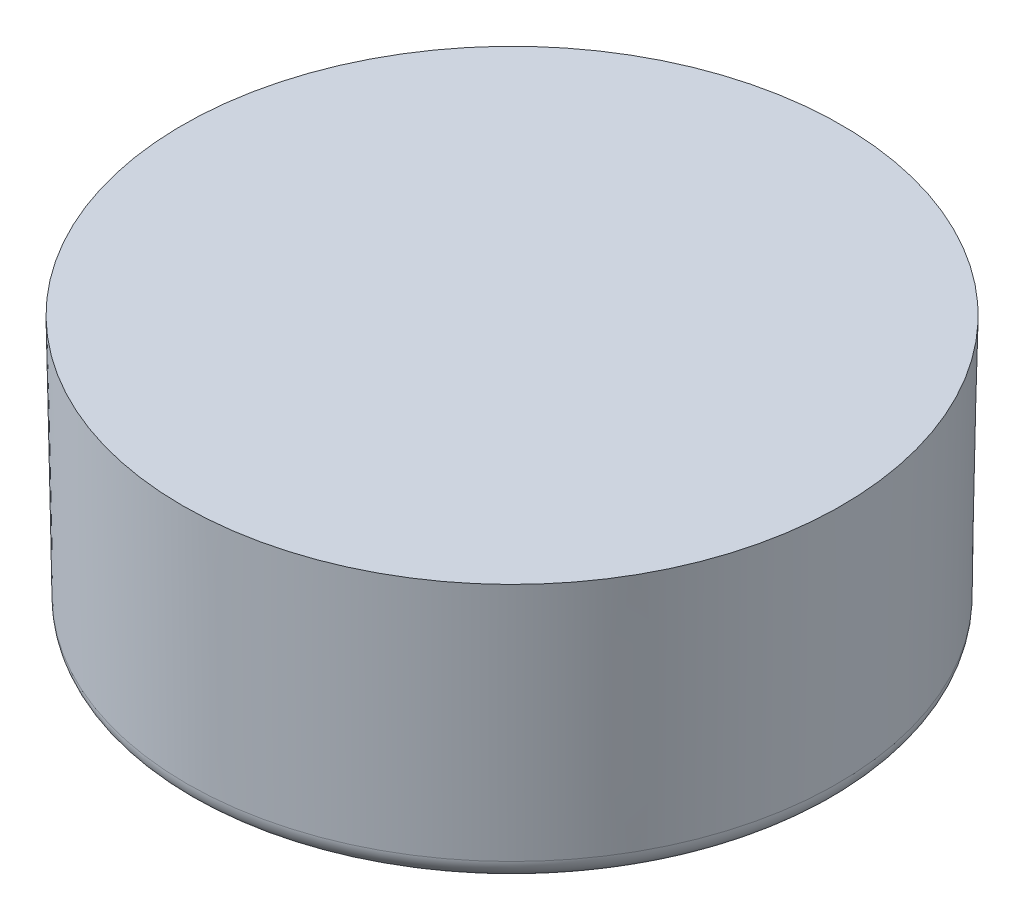
ISO-10303-21;
HEADER;
FILE_DESCRIPTION(('STEP AP214'),'2;1');
FILE_NAME('part.step','',(''),(''),'','','');
FILE_SCHEMA(('AUTOMOTIVE_DESIGN { 1 0 10303 214 1 1 1 1 }'));
ENDSEC;
DATA;
#1=APPLICATION_CONTEXT('core data for automotive mechanical design processes');
#2=APPLICATION_PROTOCOL_DEFINITION('international standard','automotive_design',2000,#1);
#3=PRODUCT_CONTEXT('',#1,'mechanical');
#4=PRODUCT('Part','Part','',(#3));
#5=PRODUCT_RELATED_PRODUCT_CATEGORY('part','',(#4));
#6=PRODUCT_DEFINITION_FORMATION('','',#4);
#7=PRODUCT_DEFINITION_CONTEXT('part definition',#1,'design');
#8=PRODUCT_DEFINITION('design','',#6,#7);
#9=PRODUCT_DEFINITION_SHAPE('','',#8);
#10=(LENGTH_UNIT() NAMED_UNIT(*) SI_UNIT(.MILLI.,.METRE.));
#11=(NAMED_UNIT(*) PLANE_ANGLE_UNIT() SI_UNIT($,.RADIAN.));
#12=(NAMED_UNIT(*) SI_UNIT($,.STERADIAN.) SOLID_ANGLE_UNIT());
#13=UNCERTAINTY_MEASURE_WITH_UNIT(LENGTH_MEASURE(1.E-05),#10,'distance_accuracy_value','');
#14=(GEOMETRIC_REPRESENTATION_CONTEXT(3) GLOBAL_UNCERTAINTY_ASSIGNED_CONTEXT((#13)) GLOBAL_UNIT_ASSIGNED_CONTEXT((#10,
#11,#12)) REPRESENTATION_CONTEXT('',''));
#15=CARTESIAN_POINT('',(0.,0.,0.));
#16=DIRECTION('',(0.,0.,1.));
#17=DIRECTION('',(1.,0.,0.));
#18=AXIS2_PLACEMENT_3D('',#15,#16,#17);
#19=CARTESIAN_POINT('',(0.,0.,0.));
#20=DIRECTION('',(0.,1.,0.));
#21=DIRECTION('',(0.,0.,1.));
#22=AXIS2_PLACEMENT_3D('',#19,#20,#21);
#23=CONICAL_SURFACE('',#22,7.9375,0.0174532925199433);
#24=CARTESIAN_POINT('',(0.,-5.85086582247014,0.));
#25=DIRECTION('',(0.,1.,0.));
#26=DIRECTION('',(0.,0.,1.));
#27=AXIS2_PLACEMENT_3D('',#24,#25,#26);
#28=CIRCLE('',#27,7.83537275718249);
#29=CARTESIAN_POINT('',(0.,-5.85086582247014,7.83537275718249));
#30=VERTEX_POINT('',#29);
#31=EDGE_CURVE('E200',#30,#30,#28,.T.);
#32=ORIENTED_EDGE('',*,*,#31,.T.);
#33=EDGE_LOOP('',(#32));
#34=FACE_BOUND('',#33,.T.);
#35=CARTESIAN_POINT('',(0.,0.,0.));
#36=DIRECTION('',(0.,1.,0.));
#37=DIRECTION('',(0.,0.,1.));
#38=AXIS2_PLACEMENT_3D('',#35,#36,#37);
#39=CIRCLE('',#38,7.9375);
#40=CARTESIAN_POINT('',(0.,0.,7.9375));
#41=VERTEX_POINT('',#40);
#42=EDGE_CURVE('E191',#41,#41,#39,.T.);
#43=ORIENTED_EDGE('',*,*,#42,.F.);
#44=EDGE_LOOP('',(#43));
#45=FACE_BOUND('',#44,.T.);
#46=ADVANCED_FACE('F37',(#34,#45),#23,.T.);
#47=CARTESIAN_POINT('',(0.,0.,0.));
#48=DIRECTION('',(0.,1.,0.));
#49=DIRECTION('',(0.,0.,1.));
#50=AXIS2_PLACEMENT_3D('',#47,#48,#49);
#51=PLANE('',#50);
#52=ORIENTED_EDGE('',*,*,#42,.T.);
#53=EDGE_LOOP('',(#52));
#54=FACE_BOUND('',#53,.T.);
#55=ADVANCED_FACE('F228',(#54),#51,.T.);
#56=CARTESIAN_POINT('',(0.,0.,0.));
#57=DIRECTION('',(0.,-1.,0.));
#58=DIRECTION('',(0.,0.,-1.));
#59=AXIS2_PLACEMENT_3D('',#56,#57,#58);
#60=CONICAL_SURFACE('',#59,5.5245,0.174532925199433);
#61=CARTESIAN_POINT('',(0.,-2.413,0.));
#62=DIRECTION('',(0.,1.,0.));
#63=DIRECTION('',(-1.,0.,0.));
#64=AXIS2_PLACEMENT_3D('',#61,#62,#63);
#65=CIRCLE('',#64,5.94997700444953);
#66=CARTESIAN_POINT('',(-5.94997700444953,-2.413,0.));
#67=VERTEX_POINT('',#66);
#68=EDGE_CURVE('E144',#67,#67,#65,.T.);
#69=ORIENTED_EDGE('',*,*,#68,.T.);
#70=EDGE_LOOP('',(#69));
#71=FACE_BOUND('',#70,.T.);
#72=CARTESIAN_POINT('',(0.,-5.9302132742548,0.));
#73=DIRECTION('',(0.,1.,0.));
#74=DIRECTION('',(0.,0.,1.));
#75=AXIS2_PLACEMENT_3D('',#72,#73,#74);
#76=CIRCLE('',#75,6.57015660160661);
#77=CARTESIAN_POINT('',(0.,-5.9302132742548,6.57015660160661));
#78=VERTEX_POINT('',#77);
#79=EDGE_CURVE('E45',#78,#78,#76,.F.);
#80=ORIENTED_EDGE('',*,*,#79,.T.);
#81=EDGE_LOOP('',(#80));
#82=FACE_BOUND('',#81,.T.);
#83=ADVANCED_FACE('F211',(#71,#82),#60,.F.);
#84=CARTESIAN_POINT('',(0.,-6.35,0.));
#85=DIRECTION('',(0.,1.,0.));
#86=DIRECTION('',(0.,0.,1.));
#87=AXIS2_PLACEMENT_3D('',#84,#85,#86);
#88=PLANE('',#87);
#89=CARTESIAN_POINT('',(0.,-6.35,0.));
#90=DIRECTION('',(0.,1.,0.));
#91=DIRECTION('',(0.,0.,1.));
#92=AXIS2_PLACEMENT_3D('',#89,#90,#91);
#93=CIRCLE('',#92,7.32745012804305);
#94=CARTESIAN_POINT('',(0.,-6.35,7.32745012804305));
#95=VERTEX_POINT('',#94);
#96=EDGE_CURVE('E206',#95,#95,#93,.F.);
#97=ORIENTED_EDGE('',*,*,#96,.T.);
#98=EDGE_LOOP('',(#97));
#99=FACE_BOUND('',#98,.T.);
#100=CARTESIAN_POINT('',(0.,-6.35,0.));
#101=DIRECTION('',(0.,1.,0.));
#102=DIRECTION('',(0.,0.,1.));
#103=AXIS2_PLACEMENT_3D('',#100,#101,#102);
#104=CIRCLE('',#103,7.07043894013681);
#105=CARTESIAN_POINT('',(0.,-6.35,7.07043894013681));
#106=VERTEX_POINT('',#105);
#107=EDGE_CURVE('E203',#106,#106,#104,.T.);
#108=ORIENTED_EDGE('',*,*,#107,.T.);
#109=EDGE_LOOP('',(#108));
#110=FACE_BOUND('',#109,.T.);
#111=ADVANCED_FACE('F219',(#99,#110),#88,.F.);
#112=CARTESIAN_POINT('',(0.,-5.842,0.));
#113=DIRECTION('',(0.,1.,0.));
#114=DIRECTION('',(0.,0.,1.));
#115=AXIS2_PLACEMENT_3D('',#112,#113,#114);
#116=TOROIDAL_SURFACE('',#115,7.32745012804305,0.508);
#117=ORIENTED_EDGE('',*,*,#96,.F.);
#118=EDGE_LOOP('',(#117));
#119=FACE_BOUND('',#118,.T.);
#120=ORIENTED_EDGE('',*,*,#31,.F.);
#121=EDGE_LOOP('',(#120));
#122=FACE_BOUND('',#121,.T.);
#123=ADVANCED_FACE('F216',(#119,#122),#116,.T.);
#124=CARTESIAN_POINT('',(0.,-5.842,0.));
#125=DIRECTION('',(0.,1.,0.));
#126=DIRECTION('',(0.,0.,1.));
#127=AXIS2_PLACEMENT_3D('',#124,#125,#126);
#128=TOROIDAL_SURFACE('',#127,7.07043894013681,0.508);
#129=ORIENTED_EDGE('',*,*,#79,.F.);
#130=EDGE_LOOP('',(#129));
#131=FACE_BOUND('',#130,.T.);
#132=ORIENTED_EDGE('',*,*,#107,.F.);
#133=EDGE_LOOP('',(#132));
#134=FACE_BOUND('',#133,.T.);
#135=ADVANCED_FACE('F39',(#131,#134),#128,.T.);
#136=CARTESIAN_POINT('',(0.,0.,0.));
#137=DIRECTION('',(0.,1.,0.));
#138=DIRECTION('',(-1.,0.,0.));
#139=AXIS2_PLACEMENT_3D('',#136,#137,#138);
#140=CYLINDRICAL_SURFACE('',#139,5.80006352766128);
#141=CARTESIAN_POINT('',(0.,-2.413,0.));
#142=DIRECTION('',(0.,1.,0.));
#143=DIRECTION('',(-1.,0.,0.));
#144=AXIS2_PLACEMENT_3D('',#141,#142,#143);
#145=CIRCLE('',#144,5.80006352766128);
#146=CARTESIAN_POINT('',(-1.98373855902874,-2.413,5.45027689703278));
#147=VERTEX_POINT('',#146);
#148=CARTESIAN_POINT('',(1.98373855902866,-2.413,5.45027689703281));
#149=VERTEX_POINT('',#148);
#150=EDGE_CURVE('E145',#147,#149,#145,.T.);
#151=ORIENTED_EDGE('',*,*,#150,.F.);
#152=CARTESIAN_POINT('',(0.,-2.413,0.));
#153=DIRECTION('',(0.664463024388672,0.707106781186549,0.24184476264798));
#154=DIRECTION('',(-0.664463024388674,0.707106781186546,-0.241844762647981));
#155=AXIS2_PLACEMENT_3D('',#152,#153,#154);
#156=ELLIPSE('',#155,8.20252850344411,5.80006352766128);
#157=CARTESIAN_POINT('',(0.,-4.39673855902869,5.80006352766128));
#158=VERTEX_POINT('',#157);
#159=EDGE_CURVE('E334',#158,#147,#156,.F.);
#160=ORIENTED_EDGE('',*,*,#159,.F.);
#161=CARTESIAN_POINT('',(0.,-2.413,0.));
#162=DIRECTION('',(-0.664463024388675,0.707106781186549,0.241844762647971));
#163=DIRECTION('',(0.664463024388677,0.707106781186546,-0.241844762647972));
#164=AXIS2_PLACEMENT_3D('',#161,#162,#163);
#165=ELLIPSE('',#164,8.20252850344411,5.80006352766128);
#166=EDGE_CURVE('E320',#149,#158,#165,.F.);
#167=ORIENTED_EDGE('',*,*,#166,.F.);
#168=EDGE_LOOP('',(#151,#160,#167));
#169=FACE_BOUND('',#168,.T.);
#170=ADVANCED_FACE('F215',(#169),#140,.T.);
#171=CARTESIAN_POINT('',(0.,-2.413,0.));
#172=DIRECTION('',(-0.353553390593276,0.707106781186549,0.612372435695792));
#173=DIRECTION('',(0.353553390593277,0.707106781186546,-0.612372435695794));
#174=AXIS2_PLACEMENT_3D('',#171,#172,#173);
#175=ELLIPSE('',#174,8.20252850344411,5.80006352766128);
#176=CARTESIAN_POINT('',(5.02300235851825,-2.413,2.90003176383066));
#177=VERTEX_POINT('',#176);
#178=CARTESIAN_POINT('',(3.72820897097545,-4.39673855902869,4.443106435102));
#179=VERTEX_POINT('',#178);
#180=EDGE_CURVE('E328',#177,#179,#175,.F.);
#181=ORIENTED_EDGE('',*,*,#180,.F.);
#182=EDGE_CURVE('E376',#149,#177,#145,.T.);
#183=ORIENTED_EDGE('',*,*,#182,.F.);
#184=CARTESIAN_POINT('',(0.,-2.413,0.));
#185=DIRECTION('',(0.664463024388675,0.707106781186549,-0.241844762647971));
#186=DIRECTION('',(-0.664463024388678,0.707106781186546,0.241844762647972));
#187=AXIS2_PLACEMENT_3D('',#184,#185,#186);
#188=ELLIPSE('',#187,8.20252850344411,5.80006352766128);
#189=EDGE_CURVE('E325',#179,#149,#188,.F.);
#190=ORIENTED_EDGE('',*,*,#189,.F.);
#191=EDGE_LOOP('',(#181,#183,#190));
#192=FACE_BOUND('',#191,.T.);
#193=ADVANCED_FACE('F367',(#192),#140,.T.);
#194=CARTESIAN_POINT('',(0.,-2.413,0.));
#195=DIRECTION('',(0.12278780396897,0.707106781186549,0.696364240320018));
#196=DIRECTION('',(-0.122787803968971,0.707106781186546,-0.69636424032002));
#197=AXIS2_PLACEMENT_3D('',#194,#195,#196);
#198=ELLIPSE('',#197,8.20252850344411,5.80006352766128);
#199=CARTESIAN_POINT('',(5.71194753000417,-2.413,-1.00717046193079));
#200=VERTEX_POINT('',#199);
#201=CARTESIAN_POINT('',(5.71194753000416,-4.39673855902869,1.00717046193083));
#202=VERTEX_POINT('',#201);
#203=EDGE_CURVE('E124',#200,#202,#198,.F.);
#204=ORIENTED_EDGE('',*,*,#203,.F.);
#205=EDGE_CURVE('E377',#177,#200,#145,.T.);
#206=ORIENTED_EDGE('',*,*,#205,.F.);
#207=CARTESIAN_POINT('',(0.,-2.413,0.));
#208=DIRECTION('',(0.353553390593276,0.707106781186549,-0.612372435695792));
#209=DIRECTION('',(-0.353553390593277,0.707106781186546,0.612372435695794));
#210=AXIS2_PLACEMENT_3D('',#207,#208,#209);
#211=ELLIPSE('',#210,8.20252850344411,5.80006352766128);
#212=EDGE_CURVE('E331',#202,#177,#211,.F.);
#213=ORIENTED_EDGE('',*,*,#212,.F.);
#214=EDGE_LOOP('',(#204,#206,#213));
#215=FACE_BOUND('',#214,.T.);
#216=ADVANCED_FACE('F372',(#215),#140,.T.);
#217=CARTESIAN_POINT('',(-5.02300235851829,-2.413,2.9000317638306));
#218=VERTEX_POINT('',#217);
#219=EDGE_CURVE('E131',#218,#147,#145,.T.);
#220=ORIENTED_EDGE('',*,*,#219,.F.);
#221=CARTESIAN_POINT('',(0.,-2.413,0.));
#222=DIRECTION('',(0.353553390593267,0.707106781186549,0.612372435695797));
#223=DIRECTION('',(-0.353553390593269,0.707106781186546,-0.612372435695799));
#224=AXIS2_PLACEMENT_3D('',#221,#222,#223);
#225=ELLIPSE('',#224,8.20252850344411,5.80006352766128);
#226=CARTESIAN_POINT('',(-3.72820897097551,-4.39673855902869,4.44310643510195));
#227=VERTEX_POINT('',#226);
#228=EDGE_CURVE('E140',#227,#218,#225,.F.);
#229=ORIENTED_EDGE('',*,*,#228,.F.);
#230=CARTESIAN_POINT('',(0.,-2.413,0.));
#231=DIRECTION('',(-0.664463024388672,0.707106781186549,-0.24184476264798));
#232=DIRECTION('',(0.664463024388674,0.707106781186546,0.241844762647981));
#233=AXIS2_PLACEMENT_3D('',#230,#231,#232);
#234=ELLIPSE('',#233,8.20252850344411,5.80006352766128);
#235=EDGE_CURVE('E142',#147,#227,#234,.F.);
#236=ORIENTED_EDGE('',*,*,#235,.F.);
#237=EDGE_LOOP('',(#220,#229,#236));
#238=FACE_BOUND('',#237,.T.);
#239=ADVANCED_FACE('F139',(#238),#140,.T.);
#240=CARTESIAN_POINT('',(-5.71194753000416,-2.413,-1.00717046193087));
#241=VERTEX_POINT('',#240);
#242=EDGE_CURVE('E116',#241,#218,#145,.T.);
#243=ORIENTED_EDGE('',*,*,#242,.F.);
#244=CARTESIAN_POINT('',(0.,-2.413,0.));
#245=DIRECTION('',(-0.12278780396898,0.707106781186549,0.696364240320017));
#246=DIRECTION('',(0.12278780396898,0.707106781186546,-0.696364240320019));
#247=AXIS2_PLACEMENT_3D('',#244,#245,#246);
#248=ELLIPSE('',#247,8.20252850344411,5.80006352766128);
#249=CARTESIAN_POINT('',(-5.71194753000418,-4.39673855902869,1.00717046193075));
#250=VERTEX_POINT('',#249);
#251=EDGE_CURVE('E119',#250,#241,#248,.F.);
#252=ORIENTED_EDGE('',*,*,#251,.F.);
#253=CARTESIAN_POINT('',(0.,-2.413,0.));
#254=DIRECTION('',(-0.353553390593268,0.707106781186549,-0.612372435695797));
#255=DIRECTION('',(0.353553390593269,0.707106781186546,0.612372435695799));
#256=AXIS2_PLACEMENT_3D('',#253,#254,#255);
#257=ELLIPSE('',#256,8.20252850344411,5.80006352766128);
#258=EDGE_CURVE('E113',#218,#250,#257,.F.);
#259=ORIENTED_EDGE('',*,*,#258,.F.);
#260=EDGE_LOOP('',(#243,#252,#259));
#261=FACE_BOUND('',#260,.T.);
#262=ADVANCED_FACE('F115',(#261),#140,.T.);
#263=CARTESIAN_POINT('',(0.,-2.413,0.));
#264=DIRECTION('',(0.5416752204197,0.707106781186549,0.454519477672044));
#265=DIRECTION('',(-0.541675220419702,0.707106781186546,-0.454519477672045));
#266=AXIS2_PLACEMENT_3D('',#263,#264,#265);
#267=ELLIPSE('',#266,8.20252850344411,5.80006352766128);
#268=CARTESIAN_POINT('',(3.72820897097548,-2.413,-4.44310643510198));
#269=VERTEX_POINT('',#268);
#270=CARTESIAN_POINT('',(5.02300235851827,-4.39673855902869,-2.90003176383063));
#271=VERTEX_POINT('',#270);
#272=EDGE_CURVE('E344',#269,#271,#267,.F.);
#273=ORIENTED_EDGE('',*,*,#272,.F.);
#274=EDGE_CURVE('E379',#200,#269,#145,.T.);
#275=ORIENTED_EDGE('',*,*,#274,.F.);
#276=CARTESIAN_POINT('',(0.,-2.413,0.));
#277=DIRECTION('',(-0.122787803968971,0.707106781186549,-0.696364240320018));
#278=DIRECTION('',(0.122787803968971,0.707106781186546,0.696364240320021));
#279=AXIS2_PLACEMENT_3D('',#276,#277,#278);
#280=ELLIPSE('',#279,8.20252850344411,5.80006352766128);
#281=EDGE_CURVE('E340',#271,#200,#280,.F.);
#282=ORIENTED_EDGE('',*,*,#281,.F.);
#283=EDGE_LOOP('',(#273,#275,#282));
#284=FACE_BOUND('',#283,.T.);
#285=ADVANCED_FACE('F401',(#284),#140,.T.);
#286=CARTESIAN_POINT('',(-3.72820897097542,-2.413,-4.44310643510203));
#287=VERTEX_POINT('',#286);
#288=EDGE_CURVE('E135',#287,#241,#145,.T.);
#289=ORIENTED_EDGE('',*,*,#288,.F.);
#290=CARTESIAN_POINT('',(0.,-2.413,0.));
#291=DIRECTION('',(-0.541675220419706,0.707106781186549,0.454519477672036));
#292=DIRECTION('',(0.541675220419708,0.707106781186546,-0.454519477672038));
#293=AXIS2_PLACEMENT_3D('',#290,#291,#292);
#294=ELLIPSE('',#293,8.20252850344411,5.80006352766128);
#295=CARTESIAN_POINT('',(-5.02300235851823,-4.39673855902869,-2.9000317638307));
#296=VERTEX_POINT('',#295);
#297=EDGE_CURVE('E314',#296,#287,#294,.F.);
#298=ORIENTED_EDGE('',*,*,#297,.F.);
#299=CARTESIAN_POINT('',(0.,-2.413,0.));
#300=DIRECTION('',(0.12278780396898,0.707106781186549,-0.696364240320017));
#301=DIRECTION('',(-0.12278780396898,0.707106781186546,0.696364240320019));
#302=AXIS2_PLACEMENT_3D('',#299,#300,#301);
#303=ELLIPSE('',#302,8.20252850344411,5.80006352766128);
#304=EDGE_CURVE('E342',#241,#296,#303,.F.);
#305=ORIENTED_EDGE('',*,*,#304,.F.);
#306=EDGE_LOOP('',(#289,#298,#305));
#307=FACE_BOUND('',#306,.T.);
#308=ADVANCED_FACE('F389',(#307),#140,.T.);
#309=CARTESIAN_POINT('',(0.,-2.413,0.));
#310=DIRECTION('',(0.707106781186546,0.707106781186549,0.));
#311=DIRECTION('',(-0.707106781186549,0.707106781186546,0.));
#312=AXIS2_PLACEMENT_3D('',#309,#310,#311);
#313=ELLIPSE('',#312,8.20252850344411,5.80006352766128);
#314=CARTESIAN_POINT('',(0.,-2.413,-5.80006352766128));
#315=VERTEX_POINT('',#314);
#316=CARTESIAN_POINT('',(1.9837385590287,-4.39673855902869,-5.45027689703279));
#317=VERTEX_POINT('',#316);
#318=EDGE_CURVE('E11',#315,#317,#313,.F.);
#319=ORIENTED_EDGE('',*,*,#318,.F.);
#320=EDGE_CURVE('E382',#269,#315,#145,.T.);
#321=ORIENTED_EDGE('',*,*,#320,.F.);
#322=CARTESIAN_POINT('',(0.,-2.413,0.));
#323=DIRECTION('',(-0.5416752204197,0.707106781186549,-0.454519477672044));
#324=DIRECTION('',(0.541675220419702,0.707106781186546,0.454519477672045));
#325=AXIS2_PLACEMENT_3D('',#322,#323,#324);
#326=ELLIPSE('',#325,8.20252850344411,5.80006352766128);
#327=EDGE_CURVE('E52',#317,#269,#326,.F.);
#328=ORIENTED_EDGE('',*,*,#327,.F.);
#329=EDGE_LOOP('',(#319,#321,#328));
#330=FACE_BOUND('',#329,.T.);
#331=ADVANCED_FACE('F363',(#330),#140,.T.);
#332=EDGE_CURVE('E385',#315,#287,#145,.T.);
#333=ORIENTED_EDGE('',*,*,#332,.F.);
#334=CARTESIAN_POINT('',(0.,-2.413,0.));
#335=DIRECTION('',(-0.707106781186546,0.707106781186549,0.));
#336=DIRECTION('',(0.707106781186549,0.707106781186546,0.));
#337=AXIS2_PLACEMENT_3D('',#334,#335,#336);
#338=ELLIPSE('',#337,8.20252850344411,5.80006352766128);
#339=CARTESIAN_POINT('',(-1.98373855902866,-4.39673855902866,-5.45027689703281));
#340=VERTEX_POINT('',#339);
#341=EDGE_CURVE('E352',#340,#315,#338,.F.);
#342=ORIENTED_EDGE('',*,*,#341,.F.);
#343=CARTESIAN_POINT('',(0.,-2.413,0.));
#344=DIRECTION('',(0.541675220419706,0.707106781186549,-0.454519477672036));
#345=DIRECTION('',(-0.541675220419708,0.707106781186546,0.454519477672038));
#346=AXIS2_PLACEMENT_3D('',#343,#344,#345);
#347=ELLIPSE('',#346,8.20252850344411,5.80006352766128);
#348=EDGE_CURVE('E349',#287,#340,#347,.F.);
#349=ORIENTED_EDGE('',*,*,#348,.F.);
#350=EDGE_LOOP('',(#333,#342,#349));
#351=FACE_BOUND('',#350,.T.);
#352=ADVANCED_FACE('F359',(#351),#140,.T.);
#353=CARTESIAN_POINT('',(0.,-2.42621689536479,0.));
#354=DIRECTION('',(0.,1.,0.));
#355=DIRECTION('',(-1.,0.,0.));
#356=AXIS2_PLACEMENT_3D('',#353,#354,#355);
#357=TOROIDAL_SURFACE('',#356,5.87502026605541,0.0761130669055491);
#358=ORIENTED_EDGE('',*,*,#68,.F.);
#359=EDGE_LOOP('',(#358));
#360=FACE_BOUND('',#359,.T.);
#361=ORIENTED_EDGE('',*,*,#219,.T.);
#362=ORIENTED_EDGE('',*,*,#150,.T.);
#363=ORIENTED_EDGE('',*,*,#182,.T.);
#364=ORIENTED_EDGE('',*,*,#205,.T.);
#365=ORIENTED_EDGE('',*,*,#274,.T.);
#366=ORIENTED_EDGE('',*,*,#320,.T.);
#367=ORIENTED_EDGE('',*,*,#332,.T.);
#368=ORIENTED_EDGE('',*,*,#288,.T.);
#369=ORIENTED_EDGE('',*,*,#242,.T.);
#370=EDGE_LOOP('',(#361,#362,#363,#364,#365,#366,#367,#368,#369));
#371=FACE_BOUND('',#370,.T.);
#372=ADVANCED_FACE('F129',(#360,#371),#357,.F.);
#373=CARTESIAN_POINT('',(0.,-2.413,-7.9375));
#374=DIRECTION('',(0.707106781186546,0.707106781186549,0.));
#375=DIRECTION('',(-0.707106781186549,0.707106781186546,0.));
#376=AXIS2_PLACEMENT_3D('',#373,#374,#375);
#377=PLANE('',#376);
#378=DIRECTION('',(0.,0.,1.));
#379=VECTOR('',#378,1.);
#380=CARTESIAN_POINT('',(0.,-2.413,-7.9375));
#381=LINE('',#380,#379);
#382=CARTESIAN_POINT('',(0.,-2.413,0.));
#383=VERTEX_POINT('',#382);
#384=EDGE_CURVE('E188',#315,#383,#381,.T.);
#385=ORIENTED_EDGE('',*,*,#384,.F.);
#386=ORIENTED_EDGE('',*,*,#318,.T.);
#387=DIRECTION('',(-0.323615577118186,0.323615577118184,0.889126490715988));
#388=VECTOR('',#387,1.);
#389=CARTESIAN_POINT('',(2.28389801049146,-4.69689801049146,-6.27495821216262));
#390=LINE('',#389,#388);
#391=EDGE_CURVE('E197',#317,#383,#390,.T.);
#392=ORIENTED_EDGE('',*,*,#391,.T.);
#393=EDGE_LOOP('',(#385,#386,#392));
#394=FACE_BOUND('',#393,.T.);
#395=ADVANCED_FACE('F243',(#394),#377,.F.);
#396=CARTESIAN_POINT('',(0.,-2.413,-7.9375));
#397=DIRECTION('',(-0.707106781186546,0.707106781186549,0.));
#398=DIRECTION('',(-0.707106781186549,-0.707106781186546,0.));
#399=AXIS2_PLACEMENT_3D('',#396,#397,#398);
#400=PLANE('',#399);
#401=DIRECTION('',(-0.32361557711818,-0.323615577118179,-0.889126490715992));
#402=VECTOR('',#401,1.);
#403=CARTESIAN_POINT('',(-2.28389801049143,-4.69689801049143,-6.27495821216267));
#404=LINE('',#403,#402);
#405=EDGE_CURVE('E194',#383,#340,#404,.T.);
#406=ORIENTED_EDGE('',*,*,#405,.T.);
#407=ORIENTED_EDGE('',*,*,#341,.T.);
#408=ORIENTED_EDGE('',*,*,#384,.T.);
#409=EDGE_LOOP('',(#406,#407,#408));
#410=FACE_BOUND('',#409,.T.);
#411=ADVANCED_FACE('F246',(#410),#400,.F.);
#412=CARTESIAN_POINT('',(-7.18803956465146,-2.413,-8.56637197488291));
#413=DIRECTION('',(0.541675220419706,0.707106781186549,-0.454519477672036));
#414=DIRECTION('',(-0.793844806099444,0.608120402411345,0.));
#415=AXIS2_PLACEMENT_3D('',#412,#413,#414);
#416=PLANE('',#415);
#417=DIRECTION('',(0.64278760968653,0.,0.766044443118986));
#418=VECTOR('',#417,1.);
#419=CARTESIAN_POINT('',(-7.18803956465146,-2.413,-8.56637197488291));
#420=LINE('',#419,#418);
#421=EDGE_CURVE('E316',#287,#383,#420,.T.);
#422=ORIENTED_EDGE('',*,*,#421,.F.);
#423=ORIENTED_EDGE('',*,*,#348,.T.);
#424=ORIENTED_EDGE('',*,*,#405,.F.);
#425=EDGE_LOOP('',(#422,#423,#424));
#426=FACE_BOUND('',#425,.T.);
#427=ADVANCED_FACE('F250',(#426),#416,.F.);
#428=CARTESIAN_POINT('',(-9.05554753256787,-2.413,-1.59673735507978));
#429=DIRECTION('',(-0.12278780396898,0.707106781186549,0.696364240320017));
#430=DIRECTION('',(0.,-0.701673843159862,0.712498293208672));
#431=AXIS2_PLACEMENT_3D('',#428,#429,#430);
#432=PLANE('',#431);
#433=DIRECTION('',(0.931813916696849,0.323615577118184,-0.164303934513275));
#434=VECTOR('',#433,1.);
#435=CARTESIAN_POINT('',(-8.9832866198233,-5.53286270198406,1.5839958065121));
#436=LINE('',#435,#434);
#437=EDGE_CURVE('E156',#250,#383,#436,.T.);
#438=ORIENTED_EDGE('',*,*,#437,.F.);
#439=ORIENTED_EDGE('',*,*,#251,.T.);
#440=DIRECTION('',(0.984807753012206,0.,0.17364817766694));
#441=VECTOR('',#440,1.);
#442=CARTESIAN_POINT('',(-9.05554753256787,-2.413,-1.59673735507978));
#443=LINE('',#442,#441);
#444=EDGE_CURVE('E161',#241,#383,#443,.T.);
#445=ORIENTED_EDGE('',*,*,#444,.T.);
#446=EDGE_LOOP('',(#438,#439,#445));
#447=FACE_BOUND('',#446,.T.);
#448=ADVANCED_FACE('F299',(#447),#432,.F.);
#449=CARTESIAN_POINT('',(-9.05554753256787,-2.413,-1.59673735507978));
#450=DIRECTION('',(0.12278780396898,0.707106781186549,-0.696364240320017));
#451=DIRECTION('',(0.,0.701673843159862,0.712498293208672));
#452=AXIS2_PLACEMENT_3D('',#449,#450,#451);
#453=PLANE('',#452);
#454=ORIENTED_EDGE('',*,*,#444,.F.);
#455=ORIENTED_EDGE('',*,*,#304,.T.);
#456=DIRECTION('',(0.819423406234433,0.323615577118184,0.473094324169742));
#457=VECTOR('',#456,1.);
#458=CARTESIAN_POINT('',(-6.69938860933185,-5.05879519532013,-3.86789381700376));
#459=LINE('',#458,#457);
#460=EDGE_CURVE('E313',#296,#383,#459,.T.);
#461=ORIENTED_EDGE('',*,*,#460,.T.);
#462=EDGE_LOOP('',(#454,#455,#461));
#463=FACE_BOUND('',#462,.T.);
#464=ADVANCED_FACE('F296',(#463),#453,.F.);
#465=CARTESIAN_POINT('',(-7.18803956465146,-2.413,-8.56637197488291));
#466=DIRECTION('',(-0.541675220419706,0.707106781186549,0.454519477672036));
#467=DIRECTION('',(-0.793844806099444,-0.608120402411345,0.));
#468=AXIS2_PLACEMENT_3D('',#465,#466,#467);
#469=PLANE('',#468);
#470=ORIENTED_EDGE('',*,*,#460,.F.);
#471=ORIENTED_EDGE('',*,*,#297,.T.);
#472=ORIENTED_EDGE('',*,*,#421,.T.);
#473=EDGE_LOOP('',(#470,#471,#472));
#474=FACE_BOUND('',#473,.T.);
#475=ADVANCED_FACE('F295',(#474),#469,.F.);
#476=CARTESIAN_POINT('',(-9.39016332126952,-2.413,5.42141332126939));
#477=DIRECTION('',(0.353553390593267,0.707106781186549,0.612372435695797));
#478=DIRECTION('',(0.,-0.654653670707978,0.755928946018454));
#479=AXIS2_PLACEMENT_3D('',#476,#477,#478);
#480=PLANE('',#479);
#481=DIRECTION('',(0.608198339578669,0.323615577118185,-0.724822556202699));
#482=VECTOR('',#481,1.);
#483=CARTESIAN_POINT('',(-5.50152673301065,-5.34030123197595,6.55646424881842));
#484=LINE('',#483,#482);
#485=EDGE_CURVE('E153',#227,#383,#484,.T.);
#486=ORIENTED_EDGE('',*,*,#485,.F.);
#487=ORIENTED_EDGE('',*,*,#228,.T.);
#488=DIRECTION('',(0.866025403784443,0.,-0.499999999999992));
#489=VECTOR('',#488,1.);
#490=CARTESIAN_POINT('',(-9.39016332126952,-2.413,5.42141332126939));
#491=LINE('',#490,#489);
#492=EDGE_CURVE('E150',#218,#383,#491,.T.);
#493=ORIENTED_EDGE('',*,*,#492,.T.);
#494=EDGE_LOOP('',(#486,#487,#493));
#495=FACE_BOUND('',#494,.T.);
#496=ADVANCED_FACE('F149',(#495),#480,.F.);
#497=CARTESIAN_POINT('',(-9.39016332126952,-2.413,5.42141332126939));
#498=DIRECTION('',(-0.353553390593268,0.707106781186549,-0.612372435695797));
#499=DIRECTION('',(0.,0.654653670707978,0.755928946018454));
#500=AXIS2_PLACEMENT_3D('',#497,#498,#499);
#501=PLANE('',#500);
#502=ORIENTED_EDGE('',*,*,#492,.F.);
#503=ORIENTED_EDGE('',*,*,#258,.T.);
#504=ORIENTED_EDGE('',*,*,#437,.T.);
#505=EDGE_LOOP('',(#502,#503,#504));
#506=FACE_BOUND('',#505,.T.);
#507=ADVANCED_FACE('F155',(#506),#501,.F.);
#508=CARTESIAN_POINT('',(-3.47957444231509,-2.413,9.5600522095719));
#509=DIRECTION('',(-0.664463024388672,0.707106781186549,-0.24184476264798));
#510=DIRECTION('',(-0.728739444818685,-0.684791078771734,0.));
#511=AXIS2_PLACEMENT_3D('',#508,#509,#510);
#512=PLANE('',#511);
#513=DIRECTION('',(0.342020143325676,0.,-0.939692620785906));
#514=VECTOR('',#513,1.);
#515=CARTESIAN_POINT('',(-3.47957444231509,-2.413,9.5600522095719));
#516=LINE('',#515,#514);
#517=EDGE_CURVE('E159',#147,#383,#516,.T.);
#518=ORIENTED_EDGE('',*,*,#517,.F.);
#519=ORIENTED_EDGE('',*,*,#235,.T.);
#520=ORIENTED_EDGE('',*,*,#485,.T.);
#521=EDGE_LOOP('',(#518,#519,#520));
#522=FACE_BOUND('',#521,.T.);
#523=ADVANCED_FACE('F283',(#522),#512,.F.);
#524=CARTESIAN_POINT('',(3.47957444231494,-2.413,9.56005220957189));
#525=DIRECTION('',(0.664463024388675,0.707106781186549,-0.241844762647971));
#526=DIRECTION('',(-0.728739444818683,0.684791078771735,0.));
#527=AXIS2_PLACEMENT_3D('',#524,#525,#526);
#528=PLANE('',#527);
#529=DIRECTION('',(-0.608198339578659,0.323615577118184,-0.724822556202708));
#530=VECTOR('',#529,1.);
#531=CARTESIAN_POINT('',(5.86342391783921,-5.53286270198407,6.98775651898777));
#532=LINE('',#531,#530);
#533=EDGE_CURVE('E173',#179,#383,#532,.T.);
#534=ORIENTED_EDGE('',*,*,#533,.F.);
#535=ORIENTED_EDGE('',*,*,#189,.T.);
#536=DIRECTION('',(-0.342020143325663,0.,-0.93969262078591));
#537=VECTOR('',#536,1.);
#538=CARTESIAN_POINT('',(3.47957444231494,-2.413,9.56005220957189));
#539=LINE('',#538,#537);
#540=EDGE_CURVE('E170',#149,#383,#539,.T.);
#541=ORIENTED_EDGE('',*,*,#540,.T.);
#542=EDGE_LOOP('',(#534,#535,#541));
#543=FACE_BOUND('',#542,.T.);
#544=ADVANCED_FACE('F279',(#543),#528,.F.);
#545=CARTESIAN_POINT('',(3.47957444231494,-2.413,9.56005220957189));
#546=DIRECTION('',(-0.664463024388675,0.707106781186549,0.241844762647971));
#547=DIRECTION('',(-0.728739444818683,-0.684791078771736,0.));
#548=AXIS2_PLACEMENT_3D('',#545,#546,#547);
#549=PLANE('',#548);
#550=ORIENTED_EDGE('',*,*,#540,.F.);
#551=ORIENTED_EDGE('',*,*,#166,.T.);
#552=DIRECTION('',(0.,0.323615577118184,-0.946188648339465));
#553=VECTOR('',#552,1.);
#554=CARTESIAN_POINT('',(0.,-5.34030123197593,8.55885622265406));
#555=LINE('',#554,#553);
#556=EDGE_CURVE('E167',#158,#383,#555,.T.);
#557=ORIENTED_EDGE('',*,*,#556,.T.);
#558=EDGE_LOOP('',(#550,#551,#557));
#559=FACE_BOUND('',#558,.T.);
#560=ADVANCED_FACE('F276',(#559),#549,.F.);
#561=CARTESIAN_POINT('',(-3.47957444231509,-2.413,9.5600522095719));
#562=DIRECTION('',(0.664463024388672,0.707106781186549,0.24184476264798));
#563=DIRECTION('',(-0.728739444818685,0.684791078771734,0.));
#564=AXIS2_PLACEMENT_3D('',#561,#562,#563);
#565=PLANE('',#564);
#566=ORIENTED_EDGE('',*,*,#556,.F.);
#567=ORIENTED_EDGE('',*,*,#159,.T.);
#568=ORIENTED_EDGE('',*,*,#517,.T.);
#569=EDGE_LOOP('',(#566,#567,#568));
#570=FACE_BOUND('',#569,.T.);
#571=ADVANCED_FACE('F274',(#570),#565,.F.);
#572=CARTESIAN_POINT('',(9.39016332126948,-2.413,5.42141332126954));
#573=DIRECTION('',(0.353553390593276,0.707106781186549,-0.612372435695792));
#574=DIRECTION('',(0.,0.654653670707975,0.755928946018456));
#575=AXIS2_PLACEMENT_3D('',#572,#573,#574);
#576=PLANE('',#575);
#577=DIRECTION('',(-0.931813916696847,0.323615577118184,-0.164303934513288));
#578=VECTOR('',#577,1.);
#579=CARTESIAN_POINT('',(7.61826363762634,-5.0587951953201,1.34330542546377));
#580=LINE('',#579,#578);
#581=EDGE_CURVE('E179',#202,#383,#580,.T.);
#582=ORIENTED_EDGE('',*,*,#581,.F.);
#583=ORIENTED_EDGE('',*,*,#212,.T.);
#584=DIRECTION('',(-0.866025403784436,0.,-0.500000000000004));
#585=VECTOR('',#584,1.);
#586=CARTESIAN_POINT('',(9.39016332126948,-2.413,5.42141332126954));
#587=LINE('',#586,#585);
#588=EDGE_CURVE('E176',#177,#383,#587,.T.);
#589=ORIENTED_EDGE('',*,*,#588,.T.);
#590=EDGE_LOOP('',(#582,#583,#589));
#591=FACE_BOUND('',#590,.T.);
#592=ADVANCED_FACE('F270',(#591),#576,.F.);
#593=CARTESIAN_POINT('',(9.39016332126948,-2.413,5.42141332126954));
#594=DIRECTION('',(-0.353553390593276,0.707106781186549,0.612372435695792));
#595=DIRECTION('',(0.,-0.654653670707975,0.755928946018457));
#596=AXIS2_PLACEMENT_3D('',#593,#594,#595);
#597=PLANE('',#596);
#598=ORIENTED_EDGE('',*,*,#588,.F.);
#599=ORIENTED_EDGE('',*,*,#180,.T.);
#600=ORIENTED_EDGE('',*,*,#533,.T.);
#601=EDGE_LOOP('',(#598,#599,#600));
#602=FACE_BOUND('',#601,.T.);
#603=ADVANCED_FACE('F264',(#602),#597,.F.);
#604=CARTESIAN_POINT('',(9.05554753256781,-2.413,-1.59673735507964));
#605=DIRECTION('',(0.12278780396897,0.707106781186549,0.696364240320018));
#606=DIRECTION('',(0.,-0.701673843159862,0.712498293208671));
#607=AXIS2_PLACEMENT_3D('',#604,#605,#606);
#608=PLANE('',#607);
#609=DIRECTION('',(-0.984807753012209,0.,0.173648177666927));
#610=VECTOR('',#609,1.);
#611=CARTESIAN_POINT('',(9.05554753256781,-2.413,-1.59673735507964));
#612=LINE('',#611,#610);
#613=EDGE_CURVE('E59',#200,#383,#612,.T.);
#614=ORIENTED_EDGE('',*,*,#613,.F.);
#615=ORIENTED_EDGE('',*,*,#203,.T.);
#616=ORIENTED_EDGE('',*,*,#581,.T.);
#617=EDGE_LOOP('',(#614,#615,#616));
#618=FACE_BOUND('',#617,.T.);
#619=ADVANCED_FACE('F256',(#618),#608,.F.);
#620=CARTESIAN_POINT('',(7.18803956465158,-2.413,-8.56637197488282));
#621=DIRECTION('',(0.5416752204197,0.707106781186549,0.454519477672044));
#622=DIRECTION('',(-0.793844806099447,0.608120402411341,0.));
#623=AXIS2_PLACEMENT_3D('',#620,#621,#622);
#624=PLANE('',#623);
#625=DIRECTION('',(-0.64278760968654,0.,0.766044443118977));
#626=VECTOR('',#625,1.);
#627=CARTESIAN_POINT('',(7.18803956465158,-2.413,-8.56637197488282));
#628=LINE('',#627,#626);
#629=EDGE_CURVE('E185',#269,#383,#628,.T.);
#630=ORIENTED_EDGE('',*,*,#629,.F.);
#631=ORIENTED_EDGE('',*,*,#272,.T.);
#632=DIRECTION('',(-0.819423406234439,0.323615577118184,0.473094324169731));
#633=VECTOR('',#632,1.);
#634=CARTESIAN_POINT('',(8.14732192833071,-5.63062872251911,-4.70385850849625));
#635=LINE('',#634,#633);
#636=EDGE_CURVE('E182',#271,#383,#635,.T.);
#637=ORIENTED_EDGE('',*,*,#636,.T.);
#638=EDGE_LOOP('',(#630,#631,#637));
#639=FACE_BOUND('',#638,.T.);
#640=ADVANCED_FACE('F252',(#639),#624,.F.);
#641=CARTESIAN_POINT('',(9.05554753256781,-2.413,-1.59673735507964));
#642=DIRECTION('',(-0.122787803968971,0.707106781186549,-0.696364240320018));
#643=DIRECTION('',(0.,0.701673843159862,0.712498293208671));
#644=AXIS2_PLACEMENT_3D('',#641,#642,#643);
#645=PLANE('',#644);
#646=ORIENTED_EDGE('',*,*,#636,.F.);
#647=ORIENTED_EDGE('',*,*,#281,.T.);
#648=ORIENTED_EDGE('',*,*,#613,.T.);
#649=EDGE_LOOP('',(#646,#647,#648));
#650=FACE_BOUND('',#649,.T.);
#651=ADVANCED_FACE('F255',(#650),#645,.F.);
#652=CARTESIAN_POINT('',(7.18803956465158,-2.413,-8.56637197488282));
#653=DIRECTION('',(-0.5416752204197,0.707106781186549,-0.454519477672044));
#654=DIRECTION('',(-0.793844806099447,-0.608120402411341,0.));
#655=AXIS2_PLACEMENT_3D('',#652,#653,#654);
#656=PLANE('',#655);
#657=ORIENTED_EDGE('',*,*,#391,.F.);
#658=ORIENTED_EDGE('',*,*,#327,.T.);
#659=ORIENTED_EDGE('',*,*,#629,.T.);
#660=EDGE_LOOP('',(#657,#658,#659));
#661=FACE_BOUND('',#660,.T.);
#662=ADVANCED_FACE('F258',(#661),#656,.F.);
#663=CLOSED_SHELL('',(#46,#55,#83,#111,#123,#135,#170,#193,#216,#239,#262,#285,#308,#331,#352,
#372,#395,#411,#427,#448,#464,#475,#496,#507,#523,#544,#560,#571,#592,#603,#619,#640,#651,#662));
#664=MANIFOLD_SOLID_BREP('B2',#663);
#665=ADVANCED_BREP_SHAPE_REPRESENTATION('',(#18,#664),#14);
#666=SHAPE_DEFINITION_REPRESENTATION(#9,#665);
ENDSEC;
END-ISO-10303-21;
